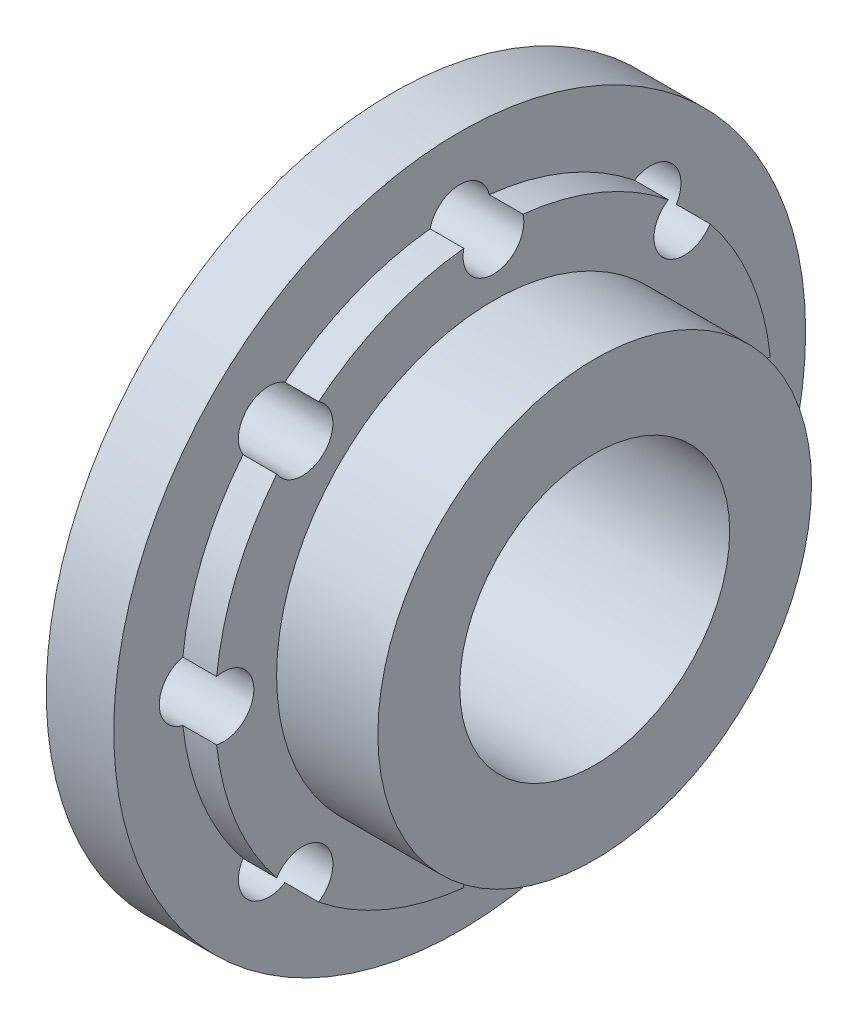
ISO-10303-21;
HEADER;
FILE_DESCRIPTION(('STEP AP214'),'2;1');
FILE_NAME('part.step','',(''),(''),'','','');
FILE_SCHEMA(('AUTOMOTIVE_DESIGN { 1 0 10303 214 1 1 1 1 }'));
ENDSEC;
DATA;
#1=APPLICATION_CONTEXT('core data for automotive mechanical design processes');
#2=APPLICATION_PROTOCOL_DEFINITION('international standard','automotive_design',2000,#1);
#3=PRODUCT_CONTEXT('',#1,'mechanical');
#4=PRODUCT('Part','Part','',(#3));
#5=PRODUCT_RELATED_PRODUCT_CATEGORY('part','',(#4));
#6=PRODUCT_DEFINITION_FORMATION('','',#4);
#7=PRODUCT_DEFINITION_CONTEXT('part definition',#1,'design');
#8=PRODUCT_DEFINITION('design','',#6,#7);
#9=PRODUCT_DEFINITION_SHAPE('','',#8);
#10=(LENGTH_UNIT() NAMED_UNIT(*) SI_UNIT(.MILLI.,.METRE.));
#11=(NAMED_UNIT(*) PLANE_ANGLE_UNIT() SI_UNIT($,.RADIAN.));
#12=(NAMED_UNIT(*) SI_UNIT($,.STERADIAN.) SOLID_ANGLE_UNIT());
#13=UNCERTAINTY_MEASURE_WITH_UNIT(LENGTH_MEASURE(1.E-05),#10,'distance_accuracy_value','');
#14=(GEOMETRIC_REPRESENTATION_CONTEXT(3) GLOBAL_UNCERTAINTY_ASSIGNED_CONTEXT((#13)) GLOBAL_UNIT_ASSIGNED_CONTEXT((#10,
#11,#12)) REPRESENTATION_CONTEXT('',''));
#15=CARTESIAN_POINT('',(0.,0.,0.));
#16=DIRECTION('',(0.,0.,1.));
#17=DIRECTION('',(1.,0.,0.));
#18=AXIS2_PLACEMENT_3D('',#15,#16,#17);
#19=CARTESIAN_POINT('',(0.,0.,0.));
#20=DIRECTION('',(1.,0.,0.));
#21=DIRECTION('',(0.,0.,-1.));
#22=AXIS2_PLACEMENT_3D('',#19,#20,#21);
#23=CYLINDRICAL_SURFACE('',#22,8.25);
#24=DIRECTION('',(-1.,0.,0.));
#25=VECTOR('',#24,1.);
#26=CARTESIAN_POINT('',(-3.,8.20328125,0.87674211339392));
#27=LINE('',#26,#25);
#28=CARTESIAN_POINT('',(-4.,8.20328125,0.876742113393926));
#29=VERTEX_POINT('',#28);
#30=CARTESIAN_POINT('',(-3.,8.20328125,0.87674211339392));
#31=VERTEX_POINT('',#30);
#32=EDGE_CURVE('E202',#29,#31,#27,.F.);
#33=ORIENTED_EDGE('',*,*,#32,.F.);
#34=CARTESIAN_POINT('',(-4.,0.,0.));
#35=DIRECTION('',(1.,0.,0.));
#36=DIRECTION('',(0.,0.,-1.));
#37=AXIS2_PLACEMENT_3D('',#34,#35,#36);
#38=CIRCLE('',#37,8.25);
#39=CARTESIAN_POINT('',(-4.,6.42054609358813,5.18064550612279));
#40=VERTEX_POINT('',#39);
#41=EDGE_CURVE('E180',#29,#40,#38,.T.);
#42=ORIENTED_EDGE('',*,*,#41,.T.);
#43=DIRECTION('',(-1.,0.,0.));
#44=VECTOR('',#43,1.);
#45=CARTESIAN_POINT('',(-3.,6.42054609358812,5.18064550612279));
#46=LINE('',#45,#44);
#47=CARTESIAN_POINT('',(-3.,6.42054609358812,5.18064550612279));
#48=VERTEX_POINT('',#47);
#49=EDGE_CURVE('E211',#48,#40,#46,.T.);
#50=ORIENTED_EDGE('',*,*,#49,.F.);
#51=CARTESIAN_POINT('',(-3.,0.,0.));
#52=DIRECTION('',(1.,0.,0.));
#53=DIRECTION('',(0.,0.,-1.));
#54=AXIS2_PLACEMENT_3D('',#51,#52,#53);
#55=CIRCLE('',#54,8.25);
#56=EDGE_CURVE('E328',#31,#48,#55,.T.);
#57=ORIENTED_EDGE('',*,*,#56,.F.);
#58=EDGE_LOOP('',(#33,#42,#50,#57));
#59=FACE_BOUND('',#58,.T.);
#60=ADVANCED_FACE('F37',(#59),#23,.T.);
#61=DIRECTION('',(-1.,0.,0.));
#62=VECTOR('',#61,1.);
#63=CARTESIAN_POINT('',(-3.,5.18064550612279,6.42054609358812));
#64=LINE('',#63,#62);
#65=CARTESIAN_POINT('',(-4.,5.18064550612279,6.42054609358813));
#66=VERTEX_POINT('',#65);
#67=CARTESIAN_POINT('',(-3.,5.18064550612279,6.42054609358813));
#68=VERTEX_POINT('',#67);
#69=EDGE_CURVE('E209',#66,#68,#64,.F.);
#70=ORIENTED_EDGE('',*,*,#69,.F.);
#71=CARTESIAN_POINT('',(-4.,0.876742113393927,8.20328125));
#72=VERTEX_POINT('',#71);
#73=EDGE_CURVE('E184',#66,#72,#38,.T.);
#74=ORIENTED_EDGE('',*,*,#73,.T.);
#75=DIRECTION('',(-1.,0.,0.));
#76=VECTOR('',#75,1.);
#77=CARTESIAN_POINT('',(-3.,0.876742113393921,8.20328125));
#78=LINE('',#77,#76);
#79=CARTESIAN_POINT('',(-3.,0.87674211339392,8.20328125));
#80=VERTEX_POINT('',#79);
#81=EDGE_CURVE('E219',#80,#72,#78,.T.);
#82=ORIENTED_EDGE('',*,*,#81,.F.);
#83=EDGE_CURVE('E343',#68,#80,#55,.T.);
#84=ORIENTED_EDGE('',*,*,#83,.F.);
#85=EDGE_LOOP('',(#70,#74,#82,#84));
#86=FACE_BOUND('',#85,.T.);
#87=ADVANCED_FACE('F317',(#86),#23,.T.);
#88=DIRECTION('',(-1.,0.,0.));
#89=VECTOR('',#88,1.);
#90=CARTESIAN_POINT('',(-3.,-0.87674211339392,8.20328125));
#91=LINE('',#90,#89);
#92=CARTESIAN_POINT('',(-4.,-0.876742113393926,8.20328125));
#93=VERTEX_POINT('',#92);
#94=CARTESIAN_POINT('',(-3.,-0.876742113393918,8.20328125));
#95=VERTEX_POINT('',#94);
#96=EDGE_CURVE('E217',#93,#95,#91,.F.);
#97=ORIENTED_EDGE('',*,*,#96,.F.);
#98=CARTESIAN_POINT('',(-4.,-5.18064550612279,6.42054609358813));
#99=VERTEX_POINT('',#98);
#100=EDGE_CURVE('E378',#93,#99,#38,.T.);
#101=ORIENTED_EDGE('',*,*,#100,.T.);
#102=DIRECTION('',(-1.,0.,0.));
#103=VECTOR('',#102,1.);
#104=CARTESIAN_POINT('',(-3.,-5.18064550612279,6.42054609358812));
#105=LINE('',#104,#103);
#106=CARTESIAN_POINT('',(-3.,-5.18064550612279,6.42054609358813));
#107=VERTEX_POINT('',#106);
#108=EDGE_CURVE('E227',#107,#99,#105,.T.);
#109=ORIENTED_EDGE('',*,*,#108,.F.);
#110=EDGE_CURVE('E346',#95,#107,#55,.T.);
#111=ORIENTED_EDGE('',*,*,#110,.F.);
#112=EDGE_LOOP('',(#97,#101,#109,#111));
#113=FACE_BOUND('',#112,.T.);
#114=ADVANCED_FACE('F322',(#113),#23,.T.);
#115=DIRECTION('',(-1.,0.,0.));
#116=VECTOR('',#115,1.);
#117=CARTESIAN_POINT('',(-3.,-6.42054609358812,5.18064550612279));
#118=LINE('',#117,#116);
#119=CARTESIAN_POINT('',(-4.,-6.42054609358813,5.18064550612279));
#120=VERTEX_POINT('',#119);
#121=CARTESIAN_POINT('',(-3.,-6.42054609358813,5.18064550612279));
#122=VERTEX_POINT('',#121);
#123=EDGE_CURVE('E225',#120,#122,#118,.F.);
#124=ORIENTED_EDGE('',*,*,#123,.F.);
#125=CARTESIAN_POINT('',(-4.,-8.20328125,0.876742113393927));
#126=VERTEX_POINT('',#125);
#127=EDGE_CURVE('E373',#120,#126,#38,.T.);
#128=ORIENTED_EDGE('',*,*,#127,.T.);
#129=DIRECTION('',(-1.,0.,0.));
#130=VECTOR('',#129,1.);
#131=CARTESIAN_POINT('',(-3.,-8.20328125,0.876742113393921));
#132=LINE('',#131,#130);
#133=CARTESIAN_POINT('',(-3.,-8.20328125,0.876742113393924));
#134=VERTEX_POINT('',#133);
#135=EDGE_CURVE('E235',#134,#126,#132,.T.);
#136=ORIENTED_EDGE('',*,*,#135,.F.);
#137=EDGE_CURVE('E348',#122,#134,#55,.T.);
#138=ORIENTED_EDGE('',*,*,#137,.F.);
#139=EDGE_LOOP('',(#124,#128,#136,#138));
#140=FACE_BOUND('',#139,.T.);
#141=ADVANCED_FACE('F393',(#140),#23,.T.);
#142=DIRECTION('',(-1.,0.,0.));
#143=VECTOR('',#142,1.);
#144=CARTESIAN_POINT('',(-3.,-8.20328125,-0.876742113393919));
#145=LINE('',#144,#143);
#146=CARTESIAN_POINT('',(-4.,-8.20328125,-0.876742113393926));
#147=VERTEX_POINT('',#146);
#148=CARTESIAN_POINT('',(-3.,-8.20328125,-0.876742113393914));
#149=VERTEX_POINT('',#148);
#150=EDGE_CURVE('E233',#147,#149,#145,.F.);
#151=ORIENTED_EDGE('',*,*,#150,.F.);
#152=CARTESIAN_POINT('',(-4.,-6.42054609358813,-5.18064550612279));
#153=VERTEX_POINT('',#152);
#154=EDGE_CURVE('E371',#147,#153,#38,.T.);
#155=ORIENTED_EDGE('',*,*,#154,.T.);
#156=DIRECTION('',(-1.,0.,0.));
#157=VECTOR('',#156,1.);
#158=CARTESIAN_POINT('',(-3.,-6.42054609358812,-5.18064550612279));
#159=LINE('',#158,#157);
#160=CARTESIAN_POINT('',(-3.,-6.42054609358813,-5.18064550612279));
#161=VERTEX_POINT('',#160);
#162=EDGE_CURVE('E62',#161,#153,#159,.T.);
#163=ORIENTED_EDGE('',*,*,#162,.F.);
#164=EDGE_CURVE('E352',#149,#161,#55,.T.);
#165=ORIENTED_EDGE('',*,*,#164,.F.);
#166=EDGE_LOOP('',(#151,#155,#163,#165));
#167=FACE_BOUND('',#166,.T.);
#168=ADVANCED_FACE('F399',(#167),#23,.T.);
#169=DIRECTION('',(-1.,0.,0.));
#170=VECTOR('',#169,1.);
#171=CARTESIAN_POINT('',(-3.,-5.18064550612279,-6.42054609358812));
#172=LINE('',#171,#170);
#173=CARTESIAN_POINT('',(-4.,-5.18064550612279,-6.42054609358813));
#174=VERTEX_POINT('',#173);
#175=CARTESIAN_POINT('',(-3.,-5.18064550612279,-6.42054609358813));
#176=VERTEX_POINT('',#175);
#177=EDGE_CURVE('E241',#174,#176,#172,.F.);
#178=ORIENTED_EDGE('',*,*,#177,.F.);
#179=CARTESIAN_POINT('',(-4.,-0.876742113393928,-8.20328125));
#180=VERTEX_POINT('',#179);
#181=EDGE_CURVE('E182',#174,#180,#38,.T.);
#182=ORIENTED_EDGE('',*,*,#181,.T.);
#183=DIRECTION('',(-1.,0.,0.));
#184=VECTOR('',#183,1.);
#185=CARTESIAN_POINT('',(-3.,-0.876742113393922,-8.20328125));
#186=LINE('',#185,#184);
#187=CARTESIAN_POINT('',(-3.,-0.876742113393924,-8.20328125));
#188=VERTEX_POINT('',#187);
#189=EDGE_CURVE('E54',#188,#180,#186,.T.);
#190=ORIENTED_EDGE('',*,*,#189,.F.);
#191=EDGE_CURVE('E181',#176,#188,#55,.T.);
#192=ORIENTED_EDGE('',*,*,#191,.F.);
#193=EDGE_LOOP('',(#178,#182,#190,#192));
#194=FACE_BOUND('',#193,.T.);
#195=ADVANCED_FACE('F370',(#194),#23,.T.);
#196=DIRECTION('',(-1.,0.,0.));
#197=VECTOR('',#196,1.);
#198=CARTESIAN_POINT('',(-3.,0.876742113393918,-8.20328125));
#199=LINE('',#198,#197);
#200=CARTESIAN_POINT('',(-4.,0.876742113393925,-8.20328125));
#201=VERTEX_POINT('',#200);
#202=CARTESIAN_POINT('',(-3.,0.876742113393919,-8.20328125));
#203=VERTEX_POINT('',#202);
#204=EDGE_CURVE('E248',#201,#203,#199,.F.);
#205=ORIENTED_EDGE('',*,*,#204,.F.);
#206=CARTESIAN_POINT('',(-4.,5.18064550612279,-6.42054609358813));
#207=VERTEX_POINT('',#206);
#208=EDGE_CURVE('E179',#201,#207,#38,.T.);
#209=ORIENTED_EDGE('',*,*,#208,.T.);
#210=DIRECTION('',(-1.,0.,0.));
#211=VECTOR('',#210,1.);
#212=CARTESIAN_POINT('',(-3.,5.18064550612279,-6.42054609358812));
#213=LINE('',#212,#211);
#214=CARTESIAN_POINT('',(-3.,5.18064550612279,-6.42054609358813));
#215=VERTEX_POINT('',#214);
#216=EDGE_CURVE('E158',#215,#207,#213,.T.);
#217=ORIENTED_EDGE('',*,*,#216,.F.);
#218=EDGE_CURVE('E41',#203,#215,#55,.T.);
#219=ORIENTED_EDGE('',*,*,#218,.F.);
#220=EDGE_LOOP('',(#205,#209,#217,#219));
#221=FACE_BOUND('',#220,.T.);
#222=ADVANCED_FACE('F314',(#221),#23,.T.);
#223=CARTESIAN_POINT('',(0.,0.,0.));
#224=DIRECTION('',(1.,0.,0.));
#225=DIRECTION('',(0.,0.,-1.));
#226=AXIS2_PLACEMENT_3D('',#223,#224,#225);
#227=CYLINDRICAL_SURFACE('',#226,4.);
#228=CARTESIAN_POINT('',(0.,0.,0.));
#229=DIRECTION('',(1.,0.,0.));
#230=DIRECTION('',(0.,0.,-1.));
#231=AXIS2_PLACEMENT_3D('',#228,#229,#230);
#232=CIRCLE('',#231,4.);
#233=CARTESIAN_POINT('',(0.,0.,-4.));
#234=VERTEX_POINT('',#233);
#235=EDGE_CURVE('E12',#234,#234,#232,.T.);
#236=ORIENTED_EDGE('',*,*,#235,.T.);
#237=EDGE_LOOP('',(#236));
#238=FACE_BOUND('',#237,.T.);
#239=CARTESIAN_POINT('',(-6.,0.,0.));
#240=DIRECTION('',(1.,0.,0.));
#241=DIRECTION('',(0.,0.,-1.));
#242=AXIS2_PLACEMENT_3D('',#239,#240,#241);
#243=CIRCLE('',#242,4.);
#244=CARTESIAN_POINT('',(-6.,0.,-4.));
#245=VERTEX_POINT('',#244);
#246=EDGE_CURVE('E197',#245,#245,#243,.T.);
#247=ORIENTED_EDGE('',*,*,#246,.F.);
#248=EDGE_LOOP('',(#247));
#249=FACE_BOUND('',#248,.T.);
#250=ADVANCED_FACE('F440',(#238,#249),#227,.F.);
#251=CARTESIAN_POINT('',(0.,4.,0.));
#252=DIRECTION('',(1.,0.,0.));
#253=DIRECTION('',(0.,0.,-1.));
#254=AXIS2_PLACEMENT_3D('',#251,#252,#253);
#255=PLANE('',#254);
#256=CARTESIAN_POINT('',(0.,0.,0.));
#257=DIRECTION('',(1.,0.,0.));
#258=DIRECTION('',(0.,0.,-1.));
#259=AXIS2_PLACEMENT_3D('',#256,#257,#258);
#260=CIRCLE('',#259,6.425);
#261=CARTESIAN_POINT('',(0.,0.,-6.425));
#262=VERTEX_POINT('',#261);
#263=EDGE_CURVE('E46',#262,#262,#260,.T.);
#264=ORIENTED_EDGE('',*,*,#263,.T.);
#265=EDGE_LOOP('',(#264));
#266=FACE_BOUND('',#265,.T.);
#267=ORIENTED_EDGE('',*,*,#235,.F.);
#268=EDGE_LOOP('',(#267));
#269=FACE_BOUND('',#268,.T.);
#270=ADVANCED_FACE('F429',(#266,#269),#255,.T.);
#271=CARTESIAN_POINT('',(0.,0.,0.));
#272=DIRECTION('',(1.,0.,0.));
#273=DIRECTION('',(0.,0.,-1.));
#274=AXIS2_PLACEMENT_3D('',#271,#272,#273);
#275=CYLINDRICAL_SURFACE('',#274,6.425);
#276=CARTESIAN_POINT('',(-3.,0.,0.));
#277=DIRECTION('',(1.,0.,0.));
#278=DIRECTION('',(0.,0.,-1.));
#279=AXIS2_PLACEMENT_3D('',#276,#277,#278);
#280=CIRCLE('',#279,6.425);
#281=CARTESIAN_POINT('',(-3.,0.,-6.425));
#282=VERTEX_POINT('',#281);
#283=EDGE_CURVE('E188',#282,#282,#280,.T.);
#284=ORIENTED_EDGE('',*,*,#283,.T.);
#285=EDGE_LOOP('',(#284));
#286=FACE_BOUND('',#285,.T.);
#287=ORIENTED_EDGE('',*,*,#263,.F.);
#288=EDGE_LOOP('',(#287));
#289=FACE_BOUND('',#288,.T.);
#290=ADVANCED_FACE('F424',(#286,#289),#275,.T.);
#291=CARTESIAN_POINT('',(-3.,6.5,0.));
#292=DIRECTION('',(1.,0.,0.));
#293=DIRECTION('',(0.,0.,-1.));
#294=AXIS2_PLACEMENT_3D('',#291,#292,#293);
#295=PLANE('',#294);
#296=CARTESIAN_POINT('',(-3.,8.,0.));
#297=DIRECTION('',(1.,0.,0.));
#298=DIRECTION('',(0.,0.,-1.));
#299=AXIS2_PLACEMENT_3D('',#296,#297,#298);
#300=CIRCLE('',#299,0.9);
#301=CARTESIAN_POINT('',(-3.,8.20328125,-0.876742113393921));
#302=VERTEX_POINT('',#301);
#303=EDGE_CURVE('E200',#31,#302,#300,.T.);
#304=ORIENTED_EDGE('',*,*,#303,.F.);
#305=ORIENTED_EDGE('',*,*,#56,.T.);
#306=CARTESIAN_POINT('',(-3.,5.65685424949238,5.65685424949238));
#307=DIRECTION('',(1.,0.,0.));
#308=DIRECTION('',(0.,0.,-1.));
#309=AXIS2_PLACEMENT_3D('',#306,#307,#308);
#310=CIRCLE('',#309,0.899999999999999);
#311=EDGE_CURVE('E207',#68,#48,#310,.T.);
#312=ORIENTED_EDGE('',*,*,#311,.F.);
#313=ORIENTED_EDGE('',*,*,#83,.T.);
#314=CARTESIAN_POINT('',(-3.,0.,8.));
#315=DIRECTION('',(1.,0.,0.));
#316=DIRECTION('',(0.,0.,-1.));
#317=AXIS2_PLACEMENT_3D('',#314,#315,#316);
#318=CIRCLE('',#317,0.9);
#319=EDGE_CURVE('E215',#95,#80,#318,.T.);
#320=ORIENTED_EDGE('',*,*,#319,.F.);
#321=ORIENTED_EDGE('',*,*,#110,.T.);
#322=CARTESIAN_POINT('',(-3.,-5.65685424949238,5.65685424949238));
#323=DIRECTION('',(1.,0.,0.));
#324=DIRECTION('',(0.,0.,-1.));
#325=AXIS2_PLACEMENT_3D('',#322,#323,#324);
#326=CIRCLE('',#325,0.899999999999999);
#327=EDGE_CURVE('E223',#122,#107,#326,.T.);
#328=ORIENTED_EDGE('',*,*,#327,.F.);
#329=ORIENTED_EDGE('',*,*,#137,.T.);
#330=CARTESIAN_POINT('',(-3.,-8.,0.));
#331=DIRECTION('',(1.,0.,0.));
#332=DIRECTION('',(0.,0.,-1.));
#333=AXIS2_PLACEMENT_3D('',#330,#331,#332);
#334=CIRCLE('',#333,0.899999999999999);
#335=EDGE_CURVE('E231',#149,#134,#334,.T.);
#336=ORIENTED_EDGE('',*,*,#335,.F.);
#337=ORIENTED_EDGE('',*,*,#164,.T.);
#338=CARTESIAN_POINT('',(-3.,-5.65685424949238,-5.65685424949238));
#339=DIRECTION('',(1.,0.,0.));
#340=DIRECTION('',(0.,0.,-1.));
#341=AXIS2_PLACEMENT_3D('',#338,#339,#340);
#342=CIRCLE('',#341,0.9);
#343=EDGE_CURVE('E239',#176,#161,#342,.T.);
#344=ORIENTED_EDGE('',*,*,#343,.F.);
#345=ORIENTED_EDGE('',*,*,#191,.T.);
#346=CARTESIAN_POINT('',(-3.,0.,-8.));
#347=DIRECTION('',(1.,0.,0.));
#348=DIRECTION('',(0.,0.,-1.));
#349=AXIS2_PLACEMENT_3D('',#346,#347,#348);
#350=CIRCLE('',#349,0.899999999999999);
#351=EDGE_CURVE('E246',#203,#188,#350,.T.);
#352=ORIENTED_EDGE('',*,*,#351,.F.);
#353=ORIENTED_EDGE('',*,*,#218,.T.);
#354=CARTESIAN_POINT('',(-3.,5.65685424949238,-5.65685424949238));
#355=DIRECTION('',(1.,0.,0.));
#356=DIRECTION('',(0.,0.,-1.));
#357=AXIS2_PLACEMENT_3D('',#354,#355,#356);
#358=CIRCLE('',#357,0.899999999999999);
#359=CARTESIAN_POINT('',(-3.,6.42054609358812,-5.18064550612279));
#360=VERTEX_POINT('',#359);
#361=EDGE_CURVE('E172',#360,#215,#358,.T.);
#362=ORIENTED_EDGE('',*,*,#361,.F.);
#363=EDGE_CURVE('E171',#360,#302,#55,.T.);
#364=ORIENTED_EDGE('',*,*,#363,.T.);
#365=EDGE_LOOP('',(#304,#305,#312,#313,#320,#321,#328,#329,#336,#337,#344,#345,#352,#353,#362,#364));
#366=FACE_BOUND('',#365,.T.);
#367=ORIENTED_EDGE('',*,*,#283,.F.);
#368=EDGE_LOOP('',(#367));
#369=FACE_BOUND('',#368,.T.);
#370=ADVANCED_FACE('F313',(#366,#369),#295,.T.);
#371=DIRECTION('',(-1.,0.,0.));
#372=VECTOR('',#371,1.);
#373=CARTESIAN_POINT('',(-3.,8.20328125,-0.87674211339392));
#374=LINE('',#373,#372);
#375=CARTESIAN_POINT('',(-4.,8.20328125,-0.876742113393926));
#376=VERTEX_POINT('',#375);
#377=EDGE_CURVE('E204',#302,#376,#374,.T.);
#378=ORIENTED_EDGE('',*,*,#377,.F.);
#379=ORIENTED_EDGE('',*,*,#363,.F.);
#380=DIRECTION('',(-1.,0.,0.));
#381=VECTOR('',#380,1.);
#382=CARTESIAN_POINT('',(-3.,6.42054609358812,-5.18064550612279));
#383=LINE('',#382,#381);
#384=CARTESIAN_POINT('',(-4.,6.42054609358813,-5.18064550612279));
#385=VERTEX_POINT('',#384);
#386=EDGE_CURVE('E155',#385,#360,#383,.F.);
#387=ORIENTED_EDGE('',*,*,#386,.F.);
#388=EDGE_CURVE('E169',#385,#376,#38,.T.);
#389=ORIENTED_EDGE('',*,*,#388,.T.);
#390=EDGE_LOOP('',(#378,#379,#387,#389));
#391=FACE_BOUND('',#390,.T.);
#392=ADVANCED_FACE('F39',(#391),#23,.T.);
#393=CARTESIAN_POINT('',(-4.,8.5,0.));
#394=DIRECTION('',(1.,0.,0.));
#395=DIRECTION('',(0.,0.,-1.));
#396=AXIS2_PLACEMENT_3D('',#393,#394,#395);
#397=PLANE('',#396);
#398=CARTESIAN_POINT('',(-4.,8.,0.));
#399=DIRECTION('',(1.,0.,0.));
#400=DIRECTION('',(0.,0.,-1.));
#401=AXIS2_PLACEMENT_3D('',#398,#399,#400);
#402=CIRCLE('',#401,0.9);
#403=EDGE_CURVE('E178',#376,#29,#402,.T.);
#404=ORIENTED_EDGE('',*,*,#403,.F.);
#405=ORIENTED_EDGE('',*,*,#388,.F.);
#406=CARTESIAN_POINT('',(-4.,5.65685424949238,-5.65685424949238));
#407=DIRECTION('',(1.,0.,0.));
#408=DIRECTION('',(0.,0.,-1.));
#409=AXIS2_PLACEMENT_3D('',#406,#407,#408);
#410=CIRCLE('',#409,0.899999999999999);
#411=EDGE_CURVE('E151',#207,#385,#410,.T.);
#412=ORIENTED_EDGE('',*,*,#411,.F.);
#413=ORIENTED_EDGE('',*,*,#208,.F.);
#414=CARTESIAN_POINT('',(-4.,0.,-8.));
#415=DIRECTION('',(1.,0.,0.));
#416=DIRECTION('',(0.,0.,-1.));
#417=AXIS2_PLACEMENT_3D('',#414,#415,#416);
#418=CIRCLE('',#417,0.899999999999999);
#419=EDGE_CURVE('E251',#180,#201,#418,.T.);
#420=ORIENTED_EDGE('',*,*,#419,.F.);
#421=ORIENTED_EDGE('',*,*,#181,.F.);
#422=CARTESIAN_POINT('',(-4.,-5.65685424949238,-5.65685424949238));
#423=DIRECTION('',(1.,0.,0.));
#424=DIRECTION('',(0.,0.,-1.));
#425=AXIS2_PLACEMENT_3D('',#422,#423,#424);
#426=CIRCLE('',#425,0.9);
#427=EDGE_CURVE('E244',#153,#174,#426,.T.);
#428=ORIENTED_EDGE('',*,*,#427,.F.);
#429=ORIENTED_EDGE('',*,*,#154,.F.);
#430=CARTESIAN_POINT('',(-4.,-8.,0.));
#431=DIRECTION('',(1.,0.,0.));
#432=DIRECTION('',(0.,0.,-1.));
#433=AXIS2_PLACEMENT_3D('',#430,#431,#432);
#434=CIRCLE('',#433,0.899999999999999);
#435=EDGE_CURVE('E237',#126,#147,#434,.T.);
#436=ORIENTED_EDGE('',*,*,#435,.F.);
#437=ORIENTED_EDGE('',*,*,#127,.F.);
#438=CARTESIAN_POINT('',(-4.,-5.65685424949238,5.65685424949238));
#439=DIRECTION('',(1.,0.,0.));
#440=DIRECTION('',(0.,0.,-1.));
#441=AXIS2_PLACEMENT_3D('',#438,#439,#440);
#442=CIRCLE('',#441,0.899999999999999);
#443=EDGE_CURVE('E229',#99,#120,#442,.T.);
#444=ORIENTED_EDGE('',*,*,#443,.F.);
#445=ORIENTED_EDGE('',*,*,#100,.F.);
#446=CARTESIAN_POINT('',(-4.,0.,8.));
#447=DIRECTION('',(1.,0.,0.));
#448=DIRECTION('',(0.,0.,-1.));
#449=AXIS2_PLACEMENT_3D('',#446,#447,#448);
#450=CIRCLE('',#449,0.9);
#451=EDGE_CURVE('E221',#72,#93,#450,.T.);
#452=ORIENTED_EDGE('',*,*,#451,.F.);
#453=ORIENTED_EDGE('',*,*,#73,.F.);
#454=CARTESIAN_POINT('',(-4.,5.65685424949238,5.65685424949238));
#455=DIRECTION('',(1.,0.,0.));
#456=DIRECTION('',(0.,0.,-1.));
#457=AXIS2_PLACEMENT_3D('',#454,#455,#456);
#458=CIRCLE('',#457,0.899999999999999);
#459=EDGE_CURVE('E213',#40,#66,#458,.T.);
#460=ORIENTED_EDGE('',*,*,#459,.F.);
#461=ORIENTED_EDGE('',*,*,#41,.F.);
#462=EDGE_LOOP('',(#404,#405,#412,#413,#420,#421,#428,#429,#436,#437,#444,#445,#452,#453,#460,#461));
#463=FACE_BOUND('',#462,.T.);
#464=CARTESIAN_POINT('',(-4.,0.,0.));
#465=DIRECTION('',(1.,0.,0.));
#466=DIRECTION('',(0.,0.,-1.));
#467=AXIS2_PLACEMENT_3D('',#464,#465,#466);
#468=CIRCLE('',#467,10.25);
#469=CARTESIAN_POINT('',(-4.,0.,-10.25));
#470=VERTEX_POINT('',#469);
#471=EDGE_CURVE('E191',#470,#470,#468,.T.);
#472=ORIENTED_EDGE('',*,*,#471,.T.);
#473=EDGE_LOOP('',(#472));
#474=FACE_BOUND('',#473,.T.);
#475=ADVANCED_FACE('F175',(#463,#474),#397,.T.);
#476=CARTESIAN_POINT('',(0.,0.,0.));
#477=DIRECTION('',(1.,0.,0.));
#478=DIRECTION('',(0.,0.,-1.));
#479=AXIS2_PLACEMENT_3D('',#476,#477,#478);
#480=CYLINDRICAL_SURFACE('',#479,10.25);
#481=CARTESIAN_POINT('',(-6.,0.,0.));
#482=DIRECTION('',(1.,0.,0.));
#483=DIRECTION('',(0.,0.,-1.));
#484=AXIS2_PLACEMENT_3D('',#481,#482,#483);
#485=CIRCLE('',#484,10.25);
#486=CARTESIAN_POINT('',(-6.,0.,-10.25));
#487=VERTEX_POINT('',#486);
#488=EDGE_CURVE('E194',#487,#487,#485,.T.);
#489=ORIENTED_EDGE('',*,*,#488,.T.);
#490=EDGE_LOOP('',(#489));
#491=FACE_BOUND('',#490,.T.);
#492=ORIENTED_EDGE('',*,*,#471,.F.);
#493=EDGE_LOOP('',(#492));
#494=FACE_BOUND('',#493,.T.);
#495=ADVANCED_FACE('F284',(#491,#494),#480,.T.);
#496=CARTESIAN_POINT('',(-6.,10.25,0.));
#497=DIRECTION('',(-1.,0.,0.));
#498=DIRECTION('',(0.,0.,1.));
#499=AXIS2_PLACEMENT_3D('',#496,#497,#498);
#500=PLANE('',#499);
#501=CARTESIAN_POINT('',(-6.,8.,0.));
#502=DIRECTION('',(-1.,0.,0.));
#503=DIRECTION('',(0.,0.,1.));
#504=AXIS2_PLACEMENT_3D('',#501,#502,#503);
#505=CIRCLE('',#504,0.9);
#506=CARTESIAN_POINT('',(-6.,8.,0.9));
#507=VERTEX_POINT('',#506);
#508=EDGE_CURVE('E163',#507,#507,#505,.T.);
#509=ORIENTED_EDGE('',*,*,#508,.F.);
#510=EDGE_LOOP('',(#509));
#511=FACE_BOUND('',#510,.T.);
#512=CARTESIAN_POINT('',(-6.,5.65685424949238,5.65685424949238));
#513=DIRECTION('',(-1.,0.,0.));
#514=DIRECTION('',(0.,0.,1.));
#515=AXIS2_PLACEMENT_3D('',#512,#513,#514);
#516=CIRCLE('',#515,0.899999999999999);
#517=CARTESIAN_POINT('',(-6.,5.65685424949238,6.55685424949238));
#518=VERTEX_POINT('',#517);
#519=EDGE_CURVE('E273',#518,#518,#516,.T.);
#520=ORIENTED_EDGE('',*,*,#519,.F.);
#521=EDGE_LOOP('',(#520));
#522=FACE_BOUND('',#521,.T.);
#523=CARTESIAN_POINT('',(-6.,0.,8.));
#524=DIRECTION('',(-1.,0.,0.));
#525=DIRECTION('',(0.,0.,1.));
#526=AXIS2_PLACEMENT_3D('',#523,#524,#525);
#527=CIRCLE('',#526,0.9);
#528=CARTESIAN_POINT('',(-6.,0.,8.9));
#529=VERTEX_POINT('',#528);
#530=EDGE_CURVE('E270',#529,#529,#527,.T.);
#531=ORIENTED_EDGE('',*,*,#530,.F.);
#532=EDGE_LOOP('',(#531));
#533=FACE_BOUND('',#532,.T.);
#534=CARTESIAN_POINT('',(-6.,-5.65685424949238,5.65685424949238));
#535=DIRECTION('',(-1.,0.,0.));
#536=DIRECTION('',(0.,0.,1.));
#537=AXIS2_PLACEMENT_3D('',#534,#535,#536);
#538=CIRCLE('',#537,0.899999999999999);
#539=CARTESIAN_POINT('',(-6.,-5.65685424949238,6.55685424949238));
#540=VERTEX_POINT('',#539);
#541=EDGE_CURVE('E267',#540,#540,#538,.T.);
#542=ORIENTED_EDGE('',*,*,#541,.F.);
#543=EDGE_LOOP('',(#542));
#544=FACE_BOUND('',#543,.T.);
#545=CARTESIAN_POINT('',(-6.,-8.,0.));
#546=DIRECTION('',(-1.,0.,0.));
#547=DIRECTION('',(0.,0.,1.));
#548=AXIS2_PLACEMENT_3D('',#545,#546,#547);
#549=CIRCLE('',#548,0.899999999999999);
#550=CARTESIAN_POINT('',(-6.,-8.,0.9));
#551=VERTEX_POINT('',#550);
#552=EDGE_CURVE('E264',#551,#551,#549,.T.);
#553=ORIENTED_EDGE('',*,*,#552,.F.);
#554=EDGE_LOOP('',(#553));
#555=FACE_BOUND('',#554,.T.);
#556=CARTESIAN_POINT('',(-6.,-5.65685424949238,-5.65685424949238));
#557=DIRECTION('',(-1.,0.,0.));
#558=DIRECTION('',(0.,0.,1.));
#559=AXIS2_PLACEMENT_3D('',#556,#557,#558);
#560=CIRCLE('',#559,0.9);
#561=CARTESIAN_POINT('',(-6.,-5.65685424949238,-4.75685424949238));
#562=VERTEX_POINT('',#561);
#563=EDGE_CURVE('E261',#562,#562,#560,.T.);
#564=ORIENTED_EDGE('',*,*,#563,.F.);
#565=EDGE_LOOP('',(#564));
#566=FACE_BOUND('',#565,.T.);
#567=CARTESIAN_POINT('',(-6.,0.,-8.));
#568=DIRECTION('',(-1.,0.,0.));
#569=DIRECTION('',(0.,0.,1.));
#570=AXIS2_PLACEMENT_3D('',#567,#568,#569);
#571=CIRCLE('',#570,0.899999999999999);
#572=CARTESIAN_POINT('',(-6.,0.,-7.1));
#573=VERTEX_POINT('',#572);
#574=EDGE_CURVE('E258',#573,#573,#571,.T.);
#575=ORIENTED_EDGE('',*,*,#574,.F.);
#576=EDGE_LOOP('',(#575));
#577=FACE_BOUND('',#576,.T.);
#578=CARTESIAN_POINT('',(-6.,5.65685424949238,-5.65685424949238));
#579=DIRECTION('',(-1.,0.,0.));
#580=DIRECTION('',(0.,0.,1.));
#581=AXIS2_PLACEMENT_3D('',#578,#579,#580);
#582=CIRCLE('',#581,0.899999999999999);
#583=CARTESIAN_POINT('',(-6.,5.65685424949238,-4.75685424949238));
#584=VERTEX_POINT('',#583);
#585=EDGE_CURVE('E255',#584,#584,#582,.T.);
#586=ORIENTED_EDGE('',*,*,#585,.F.);
#587=EDGE_LOOP('',(#586));
#588=FACE_BOUND('',#587,.T.);
#589=ORIENTED_EDGE('',*,*,#246,.T.);
#590=EDGE_LOOP('',(#589));
#591=FACE_BOUND('',#590,.T.);
#592=ORIENTED_EDGE('',*,*,#488,.F.);
#593=EDGE_LOOP('',(#592));
#594=FACE_BOUND('',#593,.T.);
#595=ADVANCED_FACE('F281',(#511,#522,#533,#544,#555,#566,#577,#588,#591,#594),#500,.T.);
#596=CARTESIAN_POINT('',(0.,5.65685424949238,-5.65685424949238));
#597=DIRECTION('',(-1.,0.,0.));
#598=DIRECTION('',(0.,0.,1.));
#599=AXIS2_PLACEMENT_3D('',#596,#597,#598);
#600=CYLINDRICAL_SURFACE('',#599,0.899999999999999);
#601=ORIENTED_EDGE('',*,*,#361,.T.);
#602=ORIENTED_EDGE('',*,*,#216,.T.);
#603=ORIENTED_EDGE('',*,*,#411,.T.);
#604=ORIENTED_EDGE('',*,*,#386,.T.);
#605=EDGE_LOOP('',(#601,#602,#603,#604));
#606=FACE_BOUND('',#605,.T.);
#607=ORIENTED_EDGE('',*,*,#585,.T.);
#608=EDGE_LOOP('',(#607));
#609=FACE_BOUND('',#608,.T.);
#610=ADVANCED_FACE('F153',(#606,#609),#600,.F.);
#611=CARTESIAN_POINT('',(0.,0.,-8.));
#612=DIRECTION('',(-1.,0.,0.));
#613=DIRECTION('',(0.,0.,1.));
#614=AXIS2_PLACEMENT_3D('',#611,#612,#613);
#615=CYLINDRICAL_SURFACE('',#614,0.899999999999999);
#616=ORIENTED_EDGE('',*,*,#351,.T.);
#617=ORIENTED_EDGE('',*,*,#189,.T.);
#618=ORIENTED_EDGE('',*,*,#419,.T.);
#619=ORIENTED_EDGE('',*,*,#204,.T.);
#620=EDGE_LOOP('',(#616,#617,#618,#619));
#621=FACE_BOUND('',#620,.T.);
#622=ORIENTED_EDGE('',*,*,#574,.T.);
#623=EDGE_LOOP('',(#622));
#624=FACE_BOUND('',#623,.T.);
#625=ADVANCED_FACE('F497',(#621,#624),#615,.F.);
#626=CARTESIAN_POINT('',(0.,-5.65685424949238,-5.65685424949238));
#627=DIRECTION('',(-1.,0.,0.));
#628=DIRECTION('',(0.,0.,1.));
#629=AXIS2_PLACEMENT_3D('',#626,#627,#628);
#630=CYLINDRICAL_SURFACE('',#629,0.9);
#631=ORIENTED_EDGE('',*,*,#343,.T.);
#632=ORIENTED_EDGE('',*,*,#162,.T.);
#633=ORIENTED_EDGE('',*,*,#427,.T.);
#634=ORIENTED_EDGE('',*,*,#177,.T.);
#635=EDGE_LOOP('',(#631,#632,#633,#634));
#636=FACE_BOUND('',#635,.T.);
#637=ORIENTED_EDGE('',*,*,#563,.T.);
#638=EDGE_LOOP('',(#637));
#639=FACE_BOUND('',#638,.T.);
#640=ADVANCED_FACE('F397',(#636,#639),#630,.F.);
#641=CARTESIAN_POINT('',(0.,-8.,0.));
#642=DIRECTION('',(-1.,0.,0.));
#643=DIRECTION('',(0.,0.,1.));
#644=AXIS2_PLACEMENT_3D('',#641,#642,#643);
#645=CYLINDRICAL_SURFACE('',#644,0.899999999999999);
#646=ORIENTED_EDGE('',*,*,#335,.T.);
#647=ORIENTED_EDGE('',*,*,#135,.T.);
#648=ORIENTED_EDGE('',*,*,#435,.T.);
#649=ORIENTED_EDGE('',*,*,#150,.T.);
#650=EDGE_LOOP('',(#646,#647,#648,#649));
#651=FACE_BOUND('',#650,.T.);
#652=ORIENTED_EDGE('',*,*,#552,.T.);
#653=EDGE_LOOP('',(#652));
#654=FACE_BOUND('',#653,.T.);
#655=ADVANCED_FACE('F395',(#651,#654),#645,.F.);
#656=CARTESIAN_POINT('',(0.,-5.65685424949238,5.65685424949238));
#657=DIRECTION('',(-1.,0.,0.));
#658=DIRECTION('',(0.,0.,1.));
#659=AXIS2_PLACEMENT_3D('',#656,#657,#658);
#660=CYLINDRICAL_SURFACE('',#659,0.899999999999999);
#661=ORIENTED_EDGE('',*,*,#327,.T.);
#662=ORIENTED_EDGE('',*,*,#108,.T.);
#663=ORIENTED_EDGE('',*,*,#443,.T.);
#664=ORIENTED_EDGE('',*,*,#123,.T.);
#665=EDGE_LOOP('',(#661,#662,#663,#664));
#666=FACE_BOUND('',#665,.T.);
#667=ORIENTED_EDGE('',*,*,#541,.T.);
#668=EDGE_LOOP('',(#667));
#669=FACE_BOUND('',#668,.T.);
#670=ADVANCED_FACE('F391',(#666,#669),#660,.F.);
#671=CARTESIAN_POINT('',(0.,0.,8.));
#672=DIRECTION('',(-1.,0.,0.));
#673=DIRECTION('',(0.,0.,1.));
#674=AXIS2_PLACEMENT_3D('',#671,#672,#673);
#675=CYLINDRICAL_SURFACE('',#674,0.9);
#676=ORIENTED_EDGE('',*,*,#319,.T.);
#677=ORIENTED_EDGE('',*,*,#81,.T.);
#678=ORIENTED_EDGE('',*,*,#451,.T.);
#679=ORIENTED_EDGE('',*,*,#96,.T.);
#680=EDGE_LOOP('',(#676,#677,#678,#679));
#681=FACE_BOUND('',#680,.T.);
#682=ORIENTED_EDGE('',*,*,#530,.T.);
#683=EDGE_LOOP('',(#682));
#684=FACE_BOUND('',#683,.T.);
#685=ADVANCED_FACE('F530',(#681,#684),#675,.F.);
#686=CARTESIAN_POINT('',(0.,5.65685424949238,5.65685424949238));
#687=DIRECTION('',(-1.,0.,0.));
#688=DIRECTION('',(0.,0.,1.));
#689=AXIS2_PLACEMENT_3D('',#686,#687,#688);
#690=CYLINDRICAL_SURFACE('',#689,0.899999999999999);
#691=ORIENTED_EDGE('',*,*,#311,.T.);
#692=ORIENTED_EDGE('',*,*,#49,.T.);
#693=ORIENTED_EDGE('',*,*,#459,.T.);
#694=ORIENTED_EDGE('',*,*,#69,.T.);
#695=EDGE_LOOP('',(#691,#692,#693,#694));
#696=FACE_BOUND('',#695,.T.);
#697=ORIENTED_EDGE('',*,*,#519,.T.);
#698=EDGE_LOOP('',(#697));
#699=FACE_BOUND('',#698,.T.);
#700=ADVANCED_FACE('F337',(#696,#699),#690,.F.);
#701=CARTESIAN_POINT('',(0.,8.,0.));
#702=DIRECTION('',(-1.,0.,0.));
#703=DIRECTION('',(0.,0.,1.));
#704=AXIS2_PLACEMENT_3D('',#701,#702,#703);
#705=CYLINDRICAL_SURFACE('',#704,0.9);
#706=ORIENTED_EDGE('',*,*,#303,.T.);
#707=ORIENTED_EDGE('',*,*,#377,.T.);
#708=ORIENTED_EDGE('',*,*,#403,.T.);
#709=ORIENTED_EDGE('',*,*,#32,.T.);
#710=EDGE_LOOP('',(#706,#707,#708,#709));
#711=FACE_BOUND('',#710,.T.);
#712=ORIENTED_EDGE('',*,*,#508,.T.);
#713=EDGE_LOOP('',(#712));
#714=FACE_BOUND('',#713,.T.);
#715=ADVANCED_FACE('F279',(#711,#714),#705,.F.);
#716=CLOSED_SHELL('',(#60,#87,#114,#141,#168,#195,#222,#250,#270,#290,#370,#392,#475,#495,#595,
#610,#625,#640,#655,#670,#685,#700,#715));
#717=MANIFOLD_SOLID_BREP('B2',#716);
#718=ADVANCED_BREP_SHAPE_REPRESENTATION('',(#18,#717),#14);
#719=SHAPE_DEFINITION_REPRESENTATION(#9,#718);
ENDSEC;
END-ISO-10303-21;
